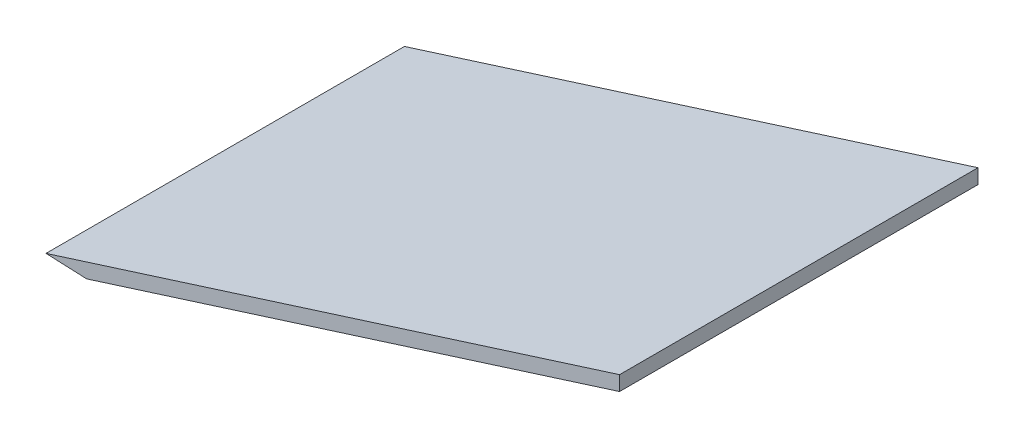
ISO-10303-21;
HEADER;
FILE_DESCRIPTION(('STEP AP214'),'2;1');
FILE_NAME('part.step','',(''),(''),'','','');
FILE_SCHEMA(('AUTOMOTIVE_DESIGN { 1 0 10303 214 1 1 1 1 }'));
ENDSEC;
DATA;
#1=APPLICATION_CONTEXT('core data for automotive mechanical design processes');
#2=APPLICATION_PROTOCOL_DEFINITION('international standard','automotive_design',2000,#1);
#3=PRODUCT_CONTEXT('',#1,'mechanical');
#4=PRODUCT('Part','Part','',(#3));
#5=PRODUCT_RELATED_PRODUCT_CATEGORY('part','',(#4));
#6=PRODUCT_DEFINITION_FORMATION('','',#4);
#7=PRODUCT_DEFINITION_CONTEXT('part definition',#1,'design');
#8=PRODUCT_DEFINITION('design','',#6,#7);
#9=PRODUCT_DEFINITION_SHAPE('','',#8);
#10=(LENGTH_UNIT() NAMED_UNIT(*) SI_UNIT(.MILLI.,.METRE.));
#11=(NAMED_UNIT(*) PLANE_ANGLE_UNIT() SI_UNIT($,.RADIAN.));
#12=(NAMED_UNIT(*) SI_UNIT($,.STERADIAN.) SOLID_ANGLE_UNIT());
#13=UNCERTAINTY_MEASURE_WITH_UNIT(LENGTH_MEASURE(1.E-05),#10,'distance_accuracy_value','');
#14=(GEOMETRIC_REPRESENTATION_CONTEXT(3) GLOBAL_UNCERTAINTY_ASSIGNED_CONTEXT((#13)) GLOBAL_UNIT_ASSIGNED_CONTEXT((#10,
#11,#12)) REPRESENTATION_CONTEXT('',''));
#15=CARTESIAN_POINT('',(0.,0.,0.));
#16=DIRECTION('',(0.,0.,1.));
#17=DIRECTION('',(1.,0.,0.));
#18=AXIS2_PLACEMENT_3D('',#15,#16,#17);
#19=CARTESIAN_POINT('',(259.100000982775,-157.771360611955,206.371686766254));
#20=DIRECTION('',(-0.302086098438233,0.953280645523849,0.));
#21=DIRECTION('',(-0.953280645523849,-0.302086098438233,0.));
#22=AXIS2_PLACEMENT_3D('',#19,#20,#21);
#23=PLANE('',#22);
#24=DIRECTION('',(0.953280645523849,0.302086098438233,0.));
#25=VECTOR('',#24,1.);
#26=CARTESIAN_POINT('',(259.100000982775,-157.771360611955,77.));
#27=LINE('',#26,#25);
#28=CARTESIAN_POINT('',(144.612166652276,-194.051529892574,77.));
#29=VERTEX_POINT('',#28);
#30=CARTESIAN_POINT('',(259.100000982775,-157.771360611955,77.));
#31=VERTEX_POINT('',#30);
#32=EDGE_CURVE('E83',#29,#31,#27,.T.);
#33=ORIENTED_EDGE('',*,*,#32,.F.);
#34=DIRECTION('',(0.,0.,-1.));
#35=VECTOR('',#34,1.);
#36=CARTESIAN_POINT('',(144.612166652276,-194.051529892574,206.371686766254));
#37=LINE('',#36,#35);
#38=CARTESIAN_POINT('',(144.612166652276,-194.051529892574,0.));
#39=VERTEX_POINT('',#38);
#40=EDGE_CURVE('E37',#29,#39,#37,.T.);
#41=ORIENTED_EDGE('',*,*,#40,.T.);
#42=DIRECTION('',(0.953280645523849,0.302086098438233,0.));
#43=VECTOR('',#42,1.);
#44=CARTESIAN_POINT('',(259.100000982775,-157.771360611955,0.));
#45=LINE('',#44,#43);
#46=CARTESIAN_POINT('',(259.100000982775,-157.771360611955,0.));
#47=VERTEX_POINT('',#46);
#48=EDGE_CURVE('E81',#39,#47,#45,.T.);
#49=ORIENTED_EDGE('',*,*,#48,.T.);
#50=DIRECTION('',(0.,0.,-1.));
#51=VECTOR('',#50,1.);
#52=CARTESIAN_POINT('',(259.100000982775,-157.771360611955,206.371686766254));
#53=LINE('',#52,#51);
#54=EDGE_CURVE('E72',#31,#47,#53,.T.);
#55=ORIENTED_EDGE('',*,*,#54,.F.);
#56=EDGE_LOOP('',(#33,#41,#49,#55));
#57=FACE_BOUND('',#56,.T.);
#58=ADVANCED_FACE('F33',(#57),#23,.F.);
#59=CARTESIAN_POINT('',(259.100000982775,-157.771360611955,206.371686766254));
#60=DIRECTION('',(-0.999999999999903,4.4026800343084E-07,0.));
#61=DIRECTION('',(-4.4026800343084E-07,-0.999999999999903,0.));
#62=AXIS2_PLACEMENT_3D('',#59,#60,#61);
#63=PLANE('',#62);
#64=DIRECTION('',(4.4026800343084E-07,0.999999999999903,0.));
#65=VECTOR('',#64,1.);
#66=CARTESIAN_POINT('',(259.100000982775,-157.771360611955,77.));
#67=LINE('',#66,#65);
#68=CARTESIAN_POINT('',(259.10000236831,-154.624333099503,77.));
#69=VERTEX_POINT('',#68);
#70=EDGE_CURVE('E42',#31,#69,#67,.T.);
#71=ORIENTED_EDGE('',*,*,#70,.F.);
#72=ORIENTED_EDGE('',*,*,#54,.T.);
#73=DIRECTION('',(4.4026800343084E-07,0.999999999999903,0.));
#74=VECTOR('',#73,1.);
#75=CARTESIAN_POINT('',(259.100000982775,-157.771360611955,0.));
#76=LINE('',#75,#74);
#77=CARTESIAN_POINT('',(259.10000236831,-154.624333099503,0.));
#78=VERTEX_POINT('',#77);
#79=EDGE_CURVE('E93',#47,#78,#76,.T.);
#80=ORIENTED_EDGE('',*,*,#79,.T.);
#81=DIRECTION('',(0.,0.,-1.));
#82=VECTOR('',#81,1.);
#83=CARTESIAN_POINT('',(259.10000236831,-154.624333099503,206.371686766254));
#84=LINE('',#83,#82);
#85=EDGE_CURVE('E102',#69,#78,#84,.T.);
#86=ORIENTED_EDGE('',*,*,#85,.F.);
#87=EDGE_LOOP('',(#71,#72,#80,#86));
#88=FACE_BOUND('',#87,.T.);
#89=ADVANCED_FACE('F106',(#88),#63,.F.);
#90=CARTESIAN_POINT('',(259.10000236831,-154.624333099503,206.371686766254));
#91=DIRECTION('',(0.302086098438232,-0.953280645523849,0.));
#92=DIRECTION('',(0.953280645523849,0.302086098438232,0.));
#93=AXIS2_PLACEMENT_3D('',#90,#91,#92);
#94=PLANE('',#93);
#95=DIRECTION('',(-0.953280645523849,-0.302086098438232,0.));
#96=VECTOR('',#95,1.);
#97=CARTESIAN_POINT('',(259.10000236831,-154.624333099503,77.));
#98=LINE('',#97,#96);
#99=CARTESIAN_POINT('',(135.882594954478,-193.670825903167,77.));
#100=VERTEX_POINT('',#99);
#101=EDGE_CURVE('E11',#69,#100,#98,.T.);
#102=ORIENTED_EDGE('',*,*,#101,.F.);
#103=ORIENTED_EDGE('',*,*,#85,.T.);
#104=DIRECTION('',(-0.953280645523849,-0.302086098438232,0.));
#105=VECTOR('',#104,1.);
#106=CARTESIAN_POINT('',(259.10000236831,-154.624333099503,0.));
#107=LINE('',#106,#105);
#108=CARTESIAN_POINT('',(135.882594954478,-193.670825903167,0.));
#109=VERTEX_POINT('',#108);
#110=EDGE_CURVE('E103',#78,#109,#107,.T.);
#111=ORIENTED_EDGE('',*,*,#110,.T.);
#112=DIRECTION('',(0.,0.,-1.));
#113=VECTOR('',#112,1.);
#114=CARTESIAN_POINT('',(135.882594954478,-193.670825903167,206.371686766254));
#115=LINE('',#114,#113);
#116=EDGE_CURVE('E55',#100,#109,#115,.T.);
#117=ORIENTED_EDGE('',*,*,#116,.F.);
#118=EDGE_LOOP('',(#102,#103,#111,#117));
#119=FACE_BOUND('',#118,.T.);
#120=ADVANCED_FACE('F105',(#119),#94,.F.);
#121=CARTESIAN_POINT('',(135.882594954478,-193.670825903167,206.371686766254));
#122=DIRECTION('',(0.0435694311958312,0.999050401463946,0.));
#123=DIRECTION('',(-0.999050401463946,0.0435694311958312,0.));
#124=AXIS2_PLACEMENT_3D('',#121,#122,#123);
#125=PLANE('',#124);
#126=DIRECTION('',(0.999050401463946,-0.0435694311958312,0.));
#127=VECTOR('',#126,1.);
#128=CARTESIAN_POINT('',(135.882594954478,-193.670825903167,77.));
#129=LINE('',#128,#127);
#130=EDGE_CURVE('E90',#100,#29,#129,.T.);
#131=ORIENTED_EDGE('',*,*,#130,.F.);
#132=ORIENTED_EDGE('',*,*,#116,.T.);
#133=DIRECTION('',(0.999050401463946,-0.0435694311958312,0.));
#134=VECTOR('',#133,1.);
#135=CARTESIAN_POINT('',(135.882594954478,-193.670825903167,0.));
#136=LINE('',#135,#134);
#137=EDGE_CURVE('E86',#109,#39,#136,.T.);
#138=ORIENTED_EDGE('',*,*,#137,.T.);
#139=ORIENTED_EDGE('',*,*,#40,.F.);
#140=EDGE_LOOP('',(#131,#132,#138,#139));
#141=FACE_BOUND('',#140,.T.);
#142=ADVANCED_FACE('F87',(#141),#125,.F.);
#143=CARTESIAN_POINT('',(0.,0.,0.));
#144=DIRECTION('',(0.,0.,-1.));
#145=DIRECTION('',(-1.,0.,0.));
#146=AXIS2_PLACEMENT_3D('',#143,#144,#145);
#147=PLANE('',#146);
#148=ORIENTED_EDGE('',*,*,#48,.F.);
#149=ORIENTED_EDGE('',*,*,#137,.F.);
#150=ORIENTED_EDGE('',*,*,#110,.F.);
#151=ORIENTED_EDGE('',*,*,#79,.F.);
#152=EDGE_LOOP('',(#148,#149,#150,#151));
#153=FACE_BOUND('',#152,.T.);
#154=ADVANCED_FACE('F92',(#153),#147,.T.);
#155=CARTESIAN_POINT('',(0.,0.,77.));
#156=DIRECTION('',(0.,0.,1.));
#157=DIRECTION('',(1.,0.,0.));
#158=AXIS2_PLACEMENT_3D('',#155,#156,#157);
#159=PLANE('',#158);
#160=ORIENTED_EDGE('',*,*,#130,.T.);
#161=ORIENTED_EDGE('',*,*,#32,.T.);
#162=ORIENTED_EDGE('',*,*,#70,.T.);
#163=ORIENTED_EDGE('',*,*,#101,.T.);
#164=EDGE_LOOP('',(#160,#161,#162,#163));
#165=FACE_BOUND('',#164,.T.);
#166=ADVANCED_FACE('F35',(#165),#159,.T.);
#167=CLOSED_SHELL('',(#58,#89,#120,#142,#154,#166));
#168=MANIFOLD_SOLID_BREP('B2',#167);
#169=ADVANCED_BREP_SHAPE_REPRESENTATION('',(#18,#168),#14);
#170=SHAPE_DEFINITION_REPRESENTATION(#9,#169);
ENDSEC;
END-ISO-10303-21;
